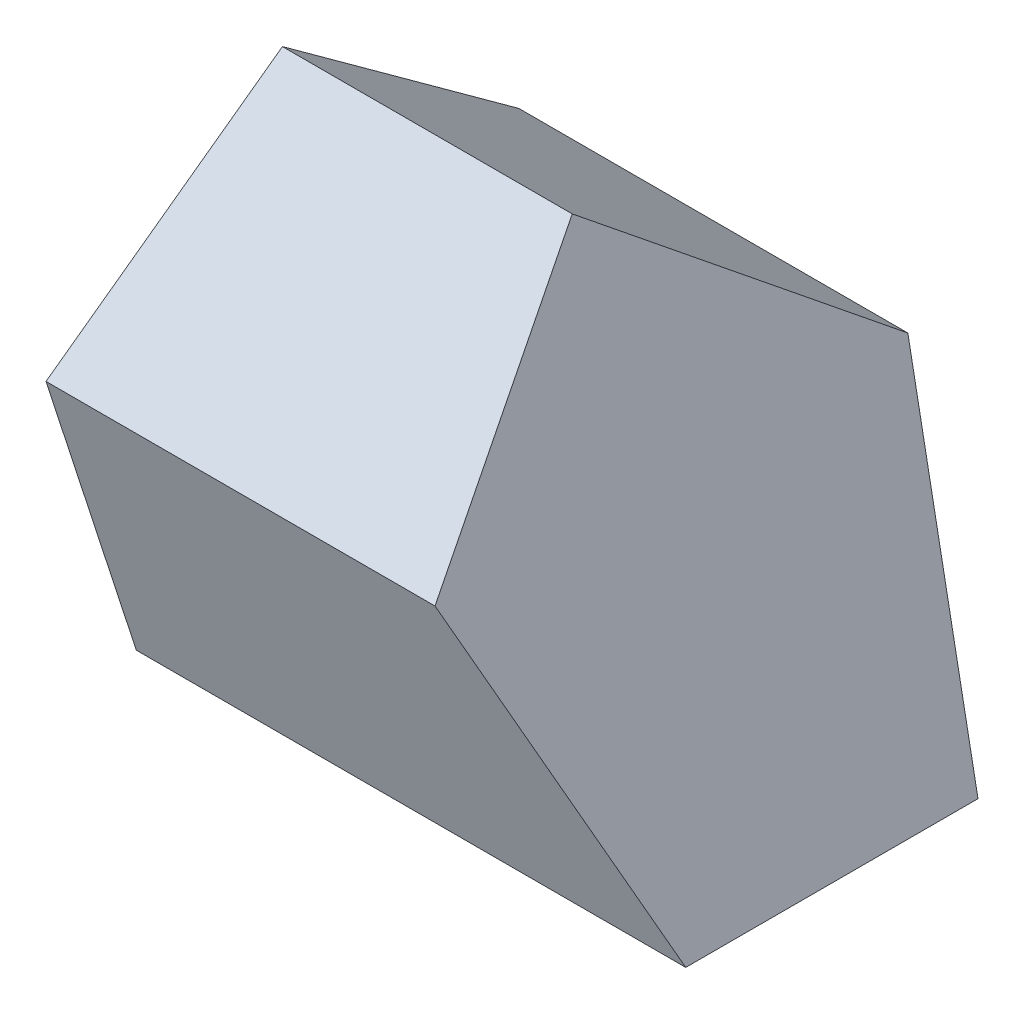
ISO-10303-21;
HEADER;
FILE_DESCRIPTION(('STEP AP214'),'2;1');
FILE_NAME('part.step','',(''),(''),'','','');
FILE_SCHEMA(('AUTOMOTIVE_DESIGN { 1 0 10303 214 1 1 1 1 }'));
ENDSEC;
DATA;
#1=APPLICATION_CONTEXT('core data for automotive mechanical design processes');
#2=APPLICATION_PROTOCOL_DEFINITION('international standard','automotive_design',2000,#1);
#3=PRODUCT_CONTEXT('',#1,'mechanical');
#4=PRODUCT('Part','Part','',(#3));
#5=PRODUCT_RELATED_PRODUCT_CATEGORY('part','',(#4));
#6=PRODUCT_DEFINITION_FORMATION('','',#4);
#7=PRODUCT_DEFINITION_CONTEXT('part definition',#1,'design');
#8=PRODUCT_DEFINITION('design','',#6,#7);
#9=PRODUCT_DEFINITION_SHAPE('','',#8);
#10=(LENGTH_UNIT() NAMED_UNIT(*) SI_UNIT(.MILLI.,.METRE.));
#11=(NAMED_UNIT(*) PLANE_ANGLE_UNIT() SI_UNIT($,.RADIAN.));
#12=(NAMED_UNIT(*) SI_UNIT($,.STERADIAN.) SOLID_ANGLE_UNIT());
#13=UNCERTAINTY_MEASURE_WITH_UNIT(LENGTH_MEASURE(1.E-05),#10,'distance_accuracy_value','');
#14=(GEOMETRIC_REPRESENTATION_CONTEXT(3) GLOBAL_UNCERTAINTY_ASSIGNED_CONTEXT((#13)) GLOBAL_UNIT_ASSIGNED_CONTEXT((#10,
#11,#12)) REPRESENTATION_CONTEXT('',''));
#15=CARTESIAN_POINT('',(0.,0.,0.));
#16=DIRECTION('',(0.,0.,1.));
#17=DIRECTION('',(1.,0.,0.));
#18=AXIS2_PLACEMENT_3D('',#15,#16,#17);
#19=CARTESIAN_POINT('',(25.,-1.87350135405495E-13,0.));
#20=DIRECTION('',(0.,-1.,0.));
#21=DIRECTION('',(-1.,0.,0.));
#22=AXIS2_PLACEMENT_3D('',#19,#20,#21);
#23=SPHERICAL_SURFACE('',#22,25.);
#24=CARTESIAN_POINT('',(46.650635094611,12.4999999999997,0.));
#25=VERTEX_POINT('',#24);
#26=VERTEX_LOOP('',#25);
#27=FACE_BOUND('',#26,.T.);
#28=ADVANCED_FACE('F40',(#27),#23,.T.);
#29=CLOSED_SHELL('',(#28));
#30=MANIFOLD_SOLID_BREP('B2',#29);
#31=CARTESIAN_POINT('',(70.,-25.0000000000002,18.1635632001343));
#32=DIRECTION('',(0.,1.,0.));
#33=DIRECTION('',(0.,0.,1.));
#34=AXIS2_PLACEMENT_3D('',#31,#32,#33);
#35=PLANE('',#34);
#36=DIRECTION('',(-1.,0.,0.));
#37=VECTOR('',#36,1.);
#38=CARTESIAN_POINT('',(70.,-25.0000000000003,-18.1635632001341));
#39=LINE('',#38,#37);
#40=CARTESIAN_POINT('',(68.3012701892219,-25.0000000000002,-18.1635632001342));
#41=VERTEX_POINT('',#40);
#42=CARTESIAN_POINT('',(0.,-25.0000000000003,-18.1635632001341));
#43=VERTEX_POINT('',#42);
#44=EDGE_CURVE('E61',#41,#43,#39,.T.);
#45=ORIENTED_EDGE('',*,*,#44,.F.);
#46=DIRECTION('',(0.,0.,1.));
#47=VECTOR('',#46,1.);
#48=CARTESIAN_POINT('',(68.3012701892219,-25.0000000000002,-30.));
#49=LINE('',#48,#47);
#50=CARTESIAN_POINT('',(68.3012701892219,-25.0000000000002,18.1635632001343));
#51=VERTEX_POINT('',#50);
#52=EDGE_CURVE('E114',#41,#51,#49,.T.);
#53=ORIENTED_EDGE('',*,*,#52,.T.);
#54=DIRECTION('',(-1.,0.,0.));
#55=VECTOR('',#54,1.);
#56=CARTESIAN_POINT('',(70.,-25.0000000000002,18.1635632001343));
#57=LINE('',#56,#55);
#58=CARTESIAN_POINT('',(0.,-25.0000000000002,18.1635632001343));
#59=VERTEX_POINT('',#58);
#60=EDGE_CURVE('E75',#51,#59,#57,.T.);
#61=ORIENTED_EDGE('',*,*,#60,.T.);
#62=DIRECTION('',(0.,0.,-1.));
#63=VECTOR('',#62,1.);
#64=CARTESIAN_POINT('',(0.,-25.0000000000002,18.1635632001343));
#65=LINE('',#64,#63);
#66=EDGE_CURVE('E135',#59,#43,#65,.T.);
#67=ORIENTED_EDGE('',*,*,#66,.T.);
#68=EDGE_LOOP('',(#45,#53,#61,#67));
#69=FACE_BOUND('',#68,.T.);
#70=ADVANCED_FACE('F54',(#69),#35,.F.);
#71=CARTESIAN_POINT('',(70.,-25.0000000000003,-18.1635632001341));
#72=DIRECTION('',(0.,0.30901699437495,0.951056516295153));
#73=DIRECTION('',(0.,-0.951056516295153,0.30901699437495));
#74=AXIS2_PLACEMENT_3D('',#71,#72,#73);
#75=PLANE('',#74);
#76=DIRECTION('',(-1.,0.,0.));
#77=VECTOR('',#76,1.);
#78=CARTESIAN_POINT('',(70.,9.54915028125263,-29.389262614624));
#79=LINE('',#78,#77);
#80=CARTESIAN_POINT('',(48.3543089740679,9.54915028125263,-29.389262614624));
#81=VERTEX_POINT('',#80);
#82=CARTESIAN_POINT('',(0.,9.54915028125263,-29.389262614624));
#83=VERTEX_POINT('',#82);
#84=EDGE_CURVE('E120',#81,#83,#79,.T.);
#85=ORIENTED_EDGE('',*,*,#84,.F.);
#86=DIRECTION('',(0.481308065483545,-0.833650023510194,0.27086931240349));
#87=VECTOR('',#86,1.);
#88=CARTESIAN_POINT('',(68.69479361205,-25.6816025623069,-17.9420971026379));
#89=LINE('',#88,#87);
#90=EDGE_CURVE('E102',#81,#41,#89,.T.);
#91=ORIENTED_EDGE('',*,*,#90,.T.);
#92=ORIENTED_EDGE('',*,*,#44,.T.);
#93=DIRECTION('',(0.,0.951056516295153,-0.30901699437495));
#94=VECTOR('',#93,1.);
#95=CARTESIAN_POINT('',(0.,-25.0000000000003,-18.1635632001341));
#96=LINE('',#95,#94);
#97=EDGE_CURVE('E130',#43,#83,#96,.T.);
#98=ORIENTED_EDGE('',*,*,#97,.T.);
#99=EDGE_LOOP('',(#85,#91,#92,#98));
#100=FACE_BOUND('',#99,.T.);
#101=ADVANCED_FACE('F129',(#100),#75,.F.);
#102=CARTESIAN_POINT('',(70.,9.54915028125263,-29.389262614624));
#103=DIRECTION('',(0.,-0.809016994374946,0.587785252292476));
#104=DIRECTION('',(0.,-0.587785252292476,-0.809016994374946));
#105=AXIS2_PLACEMENT_3D('',#102,#103,#104);
#106=PLANE('',#105);
#107=DIRECTION('',(-1.,0.,0.));
#108=VECTOR('',#107,1.);
#109=CARTESIAN_POINT('',(70.,30.901699437495,0.));
#110=LINE('',#109,#108);
#111=CARTESIAN_POINT('',(36.0264089708267,30.901699437495,0.));
#112=VERTEX_POINT('',#111);
#113=CARTESIAN_POINT('',(0.,30.901699437495,0.));
#114=VERTEX_POINT('',#113);
#115=EDGE_CURVE('E111',#112,#114,#110,.T.);
#116=ORIENTED_EDGE('',*,*,#115,.F.);
#117=DIRECTION('',(0.321357706871262,-0.556607875704855,-0.766105016912024));
#118=VECTOR('',#117,1.);
#119=CARTESIAN_POINT('',(50.5896762782974,5.67738053674877,-34.7182964911863));
#120=LINE('',#119,#118);
#121=EDGE_CURVE('E99',#112,#81,#120,.T.);
#122=ORIENTED_EDGE('',*,*,#121,.T.);
#123=ORIENTED_EDGE('',*,*,#84,.T.);
#124=DIRECTION('',(0.,0.587785252292476,0.809016994374946));
#125=VECTOR('',#124,1.);
#126=CARTESIAN_POINT('',(0.,9.54915028125263,-29.389262614624));
#127=LINE('',#126,#125);
#128=EDGE_CURVE('E118',#83,#114,#127,.T.);
#129=ORIENTED_EDGE('',*,*,#128,.T.);
#130=EDGE_LOOP('',(#116,#122,#123,#129));
#131=FACE_BOUND('',#130,.T.);
#132=ADVANCED_FACE('F116',(#131),#106,.F.);
#133=CARTESIAN_POINT('',(70.,30.901699437495,0.));
#134=DIRECTION('',(0.,-0.809016994374949,-0.587785252292471));
#135=DIRECTION('',(0.,0.587785252292471,-0.809016994374949));
#136=AXIS2_PLACEMENT_3D('',#133,#134,#135);
#137=PLANE('',#136);
#138=DIRECTION('',(-1.,0.,0.));
#139=VECTOR('',#138,1.);
#140=CARTESIAN_POINT('',(70.,9.54915028125281,29.3892626146239));
#141=LINE('',#140,#139);
#142=CARTESIAN_POINT('',(48.3543089740678,9.54915028125281,29.3892626146239));
#143=VERTEX_POINT('',#142);
#144=CARTESIAN_POINT('',(0.,9.54915028125281,29.3892626146239));
#145=VERTEX_POINT('',#144);
#146=EDGE_CURVE('E113',#143,#145,#141,.T.);
#147=ORIENTED_EDGE('',*,*,#146,.F.);
#148=DIRECTION('',(-0.321357706871259,0.556607875704851,-0.766105016912028));
#149=VECTOR('',#148,1.);
#150=CARTESIAN_POINT('',(39.5348880719511,24.8248353770539,8.36408582595211));
#151=LINE('',#150,#149);
#152=EDGE_CURVE('E68',#143,#112,#151,.T.);
#153=ORIENTED_EDGE('',*,*,#152,.T.);
#154=ORIENTED_EDGE('',*,*,#115,.T.);
#155=DIRECTION('',(0.,-0.587785252292471,0.809016994374949));
#156=VECTOR('',#155,1.);
#157=CARTESIAN_POINT('',(0.,30.901699437495,0.));
#158=LINE('',#157,#156);
#159=EDGE_CURVE('E141',#114,#145,#158,.T.);
#160=ORIENTED_EDGE('',*,*,#159,.T.);
#161=EDGE_LOOP('',(#147,#153,#154,#160));
#162=FACE_BOUND('',#161,.T.);
#163=ADVANCED_FACE('F109',(#162),#137,.F.);
#164=CARTESIAN_POINT('',(70.,9.54915028125281,29.3892626146239));
#165=DIRECTION('',(0.,0.309016994374944,-0.951056516295155));
#166=DIRECTION('',(0.,0.951056516295155,0.309016994374944));
#167=AXIS2_PLACEMENT_3D('',#164,#165,#166);
#168=PLANE('',#167);
#169=ORIENTED_EDGE('',*,*,#60,.F.);
#170=DIRECTION('',(-0.481308065483546,0.833650023510196,0.270869312403485));
#171=VECTOR('',#170,1.);
#172=CARTESIAN_POINT('',(53.3686946450308,0.863979530399479,26.5672795725257));
#173=LINE('',#172,#171);
#174=EDGE_CURVE('E38',#51,#143,#173,.T.);
#175=ORIENTED_EDGE('',*,*,#174,.T.);
#176=ORIENTED_EDGE('',*,*,#146,.T.);
#177=DIRECTION('',(0.,-0.951056516295155,-0.309016994374944));
#178=VECTOR('',#177,1.);
#179=CARTESIAN_POINT('',(0.,9.54915028125281,29.3892626146239));
#180=LINE('',#179,#178);
#181=EDGE_CURVE('E143',#145,#59,#180,.T.);
#182=ORIENTED_EDGE('',*,*,#181,.T.);
#183=EDGE_LOOP('',(#169,#175,#176,#182));
#184=FACE_BOUND('',#183,.T.);
#185=ADVANCED_FACE('F145',(#184),#168,.F.);
#186=CARTESIAN_POINT('',(0.,-25.0000000000003,-18.1635632001341));
#187=DIRECTION('',(1.,0.,0.));
#188=DIRECTION('',(0.,0.,-1.));
#189=AXIS2_PLACEMENT_3D('',#186,#187,#188);
#190=PLANE('',#189);
#191=ORIENTED_EDGE('',*,*,#66,.F.);
#192=ORIENTED_EDGE('',*,*,#181,.F.);
#193=ORIENTED_EDGE('',*,*,#159,.F.);
#194=ORIENTED_EDGE('',*,*,#128,.F.);
#195=ORIENTED_EDGE('',*,*,#97,.F.);
#196=EDGE_LOOP('',(#191,#192,#193,#194,#195));
#197=FACE_BOUND('',#196,.T.);
#198=ADVANCED_FACE('F133',(#197),#190,.F.);
#199=CARTESIAN_POINT('',(36.0264089708267,30.901699437495,-30.));
#200=DIRECTION('',(-0.86602540378444,-0.499999999999997,0.));
#201=DIRECTION('',(0.499999999999997,-0.86602540378444,0.));
#202=AXIS2_PLACEMENT_3D('',#199,#200,#201);
#203=PLANE('',#202);
#204=ORIENTED_EDGE('',*,*,#121,.F.);
#205=ORIENTED_EDGE('',*,*,#152,.F.);
#206=ORIENTED_EDGE('',*,*,#174,.F.);
#207=ORIENTED_EDGE('',*,*,#52,.F.);
#208=ORIENTED_EDGE('',*,*,#90,.F.);
#209=EDGE_LOOP('',(#204,#205,#206,#207,#208));
#210=FACE_BOUND('',#209,.T.);
#211=ADVANCED_FACE('F100',(#210),#203,.F.);
#212=CLOSED_SHELL('',(#70,#101,#132,#163,#185,#198,#211));
#213=MANIFOLD_SOLID_BREP('B6',#212);
#214=ADVANCED_BREP_SHAPE_REPRESENTATION('',(#18,#30,#213),#14);
#215=SHAPE_DEFINITION_REPRESENTATION(#9,#214);
ENDSEC;
END-ISO-10303-21;
